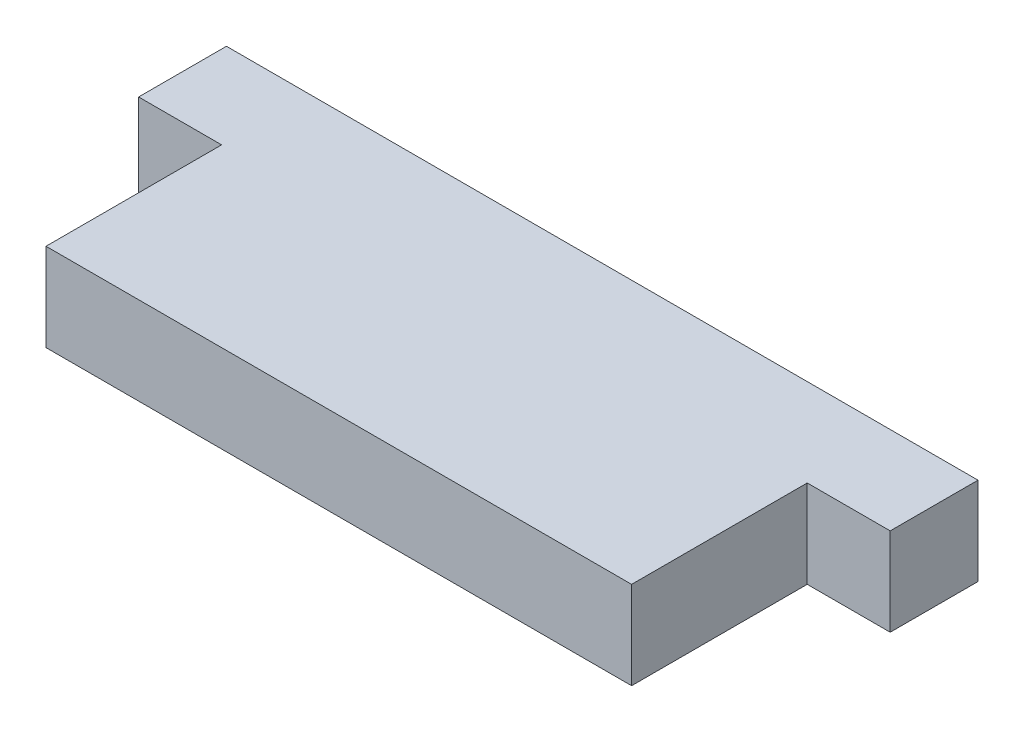
ISO-10303-21;
HEADER;
FILE_DESCRIPTION(('STEP AP214'),'2;1');
FILE_NAME('part.step','',(''),(''),'','','');
FILE_SCHEMA(('AUTOMOTIVE_DESIGN { 1 0 10303 214 1 1 1 1 }'));
ENDSEC;
DATA;
#1=APPLICATION_CONTEXT('core data for automotive mechanical design processes');
#2=APPLICATION_PROTOCOL_DEFINITION('international standard','automotive_design',2000,#1);
#3=PRODUCT_CONTEXT('',#1,'mechanical');
#4=PRODUCT('Part','Part','',(#3));
#5=PRODUCT_RELATED_PRODUCT_CATEGORY('part','',(#4));
#6=PRODUCT_DEFINITION_FORMATION('','',#4);
#7=PRODUCT_DEFINITION_CONTEXT('part definition',#1,'design');
#8=PRODUCT_DEFINITION('design','',#6,#7);
#9=PRODUCT_DEFINITION_SHAPE('','',#8);
#10=(LENGTH_UNIT() NAMED_UNIT(*) SI_UNIT(.MILLI.,.METRE.));
#11=(NAMED_UNIT(*) PLANE_ANGLE_UNIT() SI_UNIT($,.RADIAN.));
#12=(NAMED_UNIT(*) SI_UNIT($,.STERADIAN.) SOLID_ANGLE_UNIT());
#13=UNCERTAINTY_MEASURE_WITH_UNIT(LENGTH_MEASURE(1.E-05),#10,'distance_accuracy_value','');
#14=(GEOMETRIC_REPRESENTATION_CONTEXT(3) GLOBAL_UNCERTAINTY_ASSIGNED_CONTEXT((#13)) GLOBAL_UNIT_ASSIGNED_CONTEXT((#10,
#11,#12)) REPRESENTATION_CONTEXT('',''));
#15=CARTESIAN_POINT('',(0.,0.,0.));
#16=DIRECTION('',(0.,0.,1.));
#17=DIRECTION('',(1.,0.,0.));
#18=AXIS2_PLACEMENT_3D('',#15,#16,#17);
#19=CARTESIAN_POINT('',(0.,6.35,0.));
#20=DIRECTION('',(0.,0.,-1.));
#21=DIRECTION('',(-1.,0.,0.));
#22=AXIS2_PLACEMENT_3D('',#19,#20,#21);
#23=PLANE('',#22);
#24=DIRECTION('',(1.,0.,0.));
#25=VECTOR('',#24,1.);
#26=CARTESIAN_POINT('',(0.,0.,0.));
#27=LINE('',#26,#25);
#28=CARTESIAN_POINT('',(0.,0.,0.));
#29=VERTEX_POINT('',#28);
#30=CARTESIAN_POINT('',(42.350000136,0.,0.));
#31=VERTEX_POINT('',#30);
#32=EDGE_CURVE('E129',#29,#31,#27,.T.);
#33=ORIENTED_EDGE('',*,*,#32,.T.);
#34=DIRECTION('',(0.,-1.,0.));
#35=VECTOR('',#34,1.);
#36=CARTESIAN_POINT('',(42.350000136,6.35,0.));
#37=LINE('',#36,#35);
#38=CARTESIAN_POINT('',(42.350000136,6.35,0.));
#39=VERTEX_POINT('',#38);
#40=EDGE_CURVE('E11',#39,#31,#37,.T.);
#41=ORIENTED_EDGE('',*,*,#40,.F.);
#42=DIRECTION('',(1.,0.,0.));
#43=VECTOR('',#42,1.);
#44=CARTESIAN_POINT('',(0.,6.35,0.));
#45=LINE('',#44,#43);
#46=CARTESIAN_POINT('',(0.,6.35,0.));
#47=VERTEX_POINT('',#46);
#48=EDGE_CURVE('E143',#47,#39,#45,.T.);
#49=ORIENTED_EDGE('',*,*,#48,.F.);
#50=DIRECTION('',(0.,-1.,0.));
#51=VECTOR('',#50,1.);
#52=CARTESIAN_POINT('',(0.,6.35,0.));
#53=LINE('',#52,#51);
#54=EDGE_CURVE('E125',#47,#29,#53,.T.);
#55=ORIENTED_EDGE('',*,*,#54,.T.);
#56=EDGE_LOOP('',(#33,#41,#49,#55));
#57=FACE_BOUND('',#56,.T.);
#58=ADVANCED_FACE('F33',(#57),#23,.F.);
#59=CARTESIAN_POINT('',(42.350000136,6.35,0.));
#60=DIRECTION('',(-1.,0.,0.));
#61=DIRECTION('',(0.,0.,1.));
#62=AXIS2_PLACEMENT_3D('',#59,#60,#61);
#63=PLANE('',#62);
#64=DIRECTION('',(0.,0.,-1.));
#65=VECTOR('',#64,1.);
#66=CARTESIAN_POINT('',(42.350000136,0.,0.));
#67=LINE('',#66,#65);
#68=CARTESIAN_POINT('',(42.350000136,0.,-12.7));
#69=VERTEX_POINT('',#68);
#70=EDGE_CURVE('E132',#31,#69,#67,.T.);
#71=ORIENTED_EDGE('',*,*,#70,.T.);
#72=DIRECTION('',(0.,-1.,0.));
#73=VECTOR('',#72,1.);
#74=CARTESIAN_POINT('',(42.350000136,6.35,-12.7));
#75=LINE('',#74,#73);
#76=CARTESIAN_POINT('',(42.350000136,6.35,-12.7));
#77=VERTEX_POINT('',#76);
#78=EDGE_CURVE('E41',#77,#69,#75,.T.);
#79=ORIENTED_EDGE('',*,*,#78,.F.);
#80=DIRECTION('',(0.,0.,-1.));
#81=VECTOR('',#80,1.);
#82=CARTESIAN_POINT('',(42.350000136,6.35,0.));
#83=LINE('',#82,#81);
#84=EDGE_CURVE('E92',#39,#77,#83,.T.);
#85=ORIENTED_EDGE('',*,*,#84,.F.);
#86=ORIENTED_EDGE('',*,*,#40,.T.);
#87=EDGE_LOOP('',(#71,#79,#85,#86));
#88=FACE_BOUND('',#87,.T.);
#89=ADVANCED_FACE('F178',(#88),#63,.F.);
#90=CARTESIAN_POINT('',(42.350000136,6.35,-12.7));
#91=DIRECTION('',(0.,0.,-1.));
#92=DIRECTION('',(-1.,0.,0.));
#93=AXIS2_PLACEMENT_3D('',#90,#91,#92);
#94=PLANE('',#93);
#95=DIRECTION('',(1.,0.,0.));
#96=VECTOR('',#95,1.);
#97=CARTESIAN_POINT('',(42.350000136,0.,-12.7));
#98=LINE('',#97,#96);
#99=CARTESIAN_POINT('',(48.350089736,0.,-12.7));
#100=VERTEX_POINT('',#99);
#101=EDGE_CURVE('E134',#69,#100,#98,.T.);
#102=ORIENTED_EDGE('',*,*,#101,.T.);
#103=DIRECTION('',(0.,-1.,0.));
#104=VECTOR('',#103,1.);
#105=CARTESIAN_POINT('',(48.350089736,6.35,-12.7));
#106=LINE('',#105,#104);
#107=CARTESIAN_POINT('',(48.350089736,6.35,-12.7));
#108=VERTEX_POINT('',#107);
#109=EDGE_CURVE('E150',#108,#100,#106,.T.);
#110=ORIENTED_EDGE('',*,*,#109,.F.);
#111=DIRECTION('',(1.,0.,0.));
#112=VECTOR('',#111,1.);
#113=CARTESIAN_POINT('',(42.350000136,6.35,-12.7));
#114=LINE('',#113,#112);
#115=EDGE_CURVE('E158',#77,#108,#114,.T.);
#116=ORIENTED_EDGE('',*,*,#115,.F.);
#117=ORIENTED_EDGE('',*,*,#78,.T.);
#118=EDGE_LOOP('',(#102,#110,#116,#117));
#119=FACE_BOUND('',#118,.T.);
#120=ADVANCED_FACE('F156',(#119),#94,.F.);
#121=CARTESIAN_POINT('',(48.350089736,6.35,-19.05));
#122=DIRECTION('',(-1.,0.,0.));
#123=DIRECTION('',(0.,0.,1.));
#124=AXIS2_PLACEMENT_3D('',#121,#122,#123);
#125=PLANE('',#124);
#126=DIRECTION('',(0.,0.,-1.));
#127=VECTOR('',#126,1.);
#128=CARTESIAN_POINT('',(48.350089736,0.,-19.05));
#129=LINE('',#128,#127);
#130=CARTESIAN_POINT('',(48.350089736,0.,-19.05));
#131=VERTEX_POINT('',#130);
#132=EDGE_CURVE('E136',#100,#131,#129,.T.);
#133=ORIENTED_EDGE('',*,*,#132,.T.);
#134=DIRECTION('',(0.,-1.,0.));
#135=VECTOR('',#134,1.);
#136=CARTESIAN_POINT('',(48.350089736,6.35,-19.05));
#137=LINE('',#136,#135);
#138=CARTESIAN_POINT('',(48.350089736,6.35,-19.05));
#139=VERTEX_POINT('',#138);
#140=EDGE_CURVE('E147',#139,#131,#137,.T.);
#141=ORIENTED_EDGE('',*,*,#140,.F.);
#142=DIRECTION('',(0.,0.,-1.));
#143=VECTOR('',#142,1.);
#144=CARTESIAN_POINT('',(48.350089736,6.35,-19.05));
#145=LINE('',#144,#143);
#146=EDGE_CURVE('E170',#108,#139,#145,.T.);
#147=ORIENTED_EDGE('',*,*,#146,.F.);
#148=ORIENTED_EDGE('',*,*,#109,.T.);
#149=EDGE_LOOP('',(#133,#141,#147,#148));
#150=FACE_BOUND('',#149,.T.);
#151=ADVANCED_FACE('F166',(#150),#125,.F.);
#152=CARTESIAN_POINT('',(-6.0000896,6.35,-19.05));
#153=DIRECTION('',(0.,0.,1.));
#154=DIRECTION('',(1.,0.,0.));
#155=AXIS2_PLACEMENT_3D('',#152,#153,#154);
#156=PLANE('',#155);
#157=DIRECTION('',(-1.,0.,0.));
#158=VECTOR('',#157,1.);
#159=CARTESIAN_POINT('',(-6.0000896,0.,-19.05));
#160=LINE('',#159,#158);
#161=CARTESIAN_POINT('',(-6.0000896,0.,-19.05));
#162=VERTEX_POINT('',#161);
#163=EDGE_CURVE('E138',#131,#162,#160,.T.);
#164=ORIENTED_EDGE('',*,*,#163,.T.);
#165=DIRECTION('',(0.,-1.,0.));
#166=VECTOR('',#165,1.);
#167=CARTESIAN_POINT('',(-6.0000896,6.35,-19.05));
#168=LINE('',#167,#166);
#169=CARTESIAN_POINT('',(-6.0000896,6.35,-19.05));
#170=VERTEX_POINT('',#169);
#171=EDGE_CURVE('E120',#170,#162,#168,.T.);
#172=ORIENTED_EDGE('',*,*,#171,.F.);
#173=DIRECTION('',(-1.,0.,0.));
#174=VECTOR('',#173,1.);
#175=CARTESIAN_POINT('',(-6.0000896,6.35,-19.05));
#176=LINE('',#175,#174);
#177=EDGE_CURVE('E111',#139,#170,#176,.T.);
#178=ORIENTED_EDGE('',*,*,#177,.F.);
#179=ORIENTED_EDGE('',*,*,#140,.T.);
#180=EDGE_LOOP('',(#164,#172,#178,#179));
#181=FACE_BOUND('',#180,.T.);
#182=ADVANCED_FACE('F169',(#181),#156,.F.);
#183=CARTESIAN_POINT('',(-6.0000896,6.35,-19.05));
#184=DIRECTION('',(1.,0.,0.));
#185=DIRECTION('',(0.,0.,-1.));
#186=AXIS2_PLACEMENT_3D('',#183,#184,#185);
#187=PLANE('',#186);
#188=DIRECTION('',(0.,0.,1.));
#189=VECTOR('',#188,1.);
#190=CARTESIAN_POINT('',(-6.0000896,0.,-19.05));
#191=LINE('',#190,#189);
#192=CARTESIAN_POINT('',(-6.0000896,0.,-12.7));
#193=VERTEX_POINT('',#192);
#194=EDGE_CURVE('E119',#162,#193,#191,.T.);
#195=ORIENTED_EDGE('',*,*,#194,.T.);
#196=DIRECTION('',(0.,-1.,0.));
#197=VECTOR('',#196,1.);
#198=CARTESIAN_POINT('',(-6.0000896,6.35,-12.7));
#199=LINE('',#198,#197);
#200=CARTESIAN_POINT('',(-6.0000896,6.35,-12.7));
#201=VERTEX_POINT('',#200);
#202=EDGE_CURVE('E116',#201,#193,#199,.T.);
#203=ORIENTED_EDGE('',*,*,#202,.F.);
#204=DIRECTION('',(0.,0.,1.));
#205=VECTOR('',#204,1.);
#206=CARTESIAN_POINT('',(-6.0000896,6.35,-19.05));
#207=LINE('',#206,#205);
#208=EDGE_CURVE('E105',#170,#201,#207,.T.);
#209=ORIENTED_EDGE('',*,*,#208,.F.);
#210=ORIENTED_EDGE('',*,*,#171,.T.);
#211=EDGE_LOOP('',(#195,#203,#209,#210));
#212=FACE_BOUND('',#211,.T.);
#213=ADVANCED_FACE('F117',(#212),#187,.F.);
#214=CARTESIAN_POINT('',(-6.0000896,6.35,-12.7));
#215=DIRECTION('',(0.,0.,-1.));
#216=DIRECTION('',(-1.,0.,0.));
#217=AXIS2_PLACEMENT_3D('',#214,#215,#216);
#218=PLANE('',#217);
#219=DIRECTION('',(1.,0.,0.));
#220=VECTOR('',#219,1.);
#221=CARTESIAN_POINT('',(-6.0000896,0.,-12.7));
#222=LINE('',#221,#220);
#223=CARTESIAN_POINT('',(0.,0.,-12.7));
#224=VERTEX_POINT('',#223);
#225=EDGE_CURVE('E78',#193,#224,#222,.T.);
#226=ORIENTED_EDGE('',*,*,#225,.T.);
#227=DIRECTION('',(0.,-1.,0.));
#228=VECTOR('',#227,1.);
#229=CARTESIAN_POINT('',(0.,6.35,-12.7));
#230=LINE('',#229,#228);
#231=CARTESIAN_POINT('',(0.,6.35,-12.7));
#232=VERTEX_POINT('',#231);
#233=EDGE_CURVE('E121',#232,#224,#230,.T.);
#234=ORIENTED_EDGE('',*,*,#233,.F.);
#235=DIRECTION('',(1.,0.,0.));
#236=VECTOR('',#235,1.);
#237=CARTESIAN_POINT('',(-6.0000896,6.35,-12.7));
#238=LINE('',#237,#236);
#239=EDGE_CURVE('E109',#201,#232,#238,.T.);
#240=ORIENTED_EDGE('',*,*,#239,.F.);
#241=ORIENTED_EDGE('',*,*,#202,.T.);
#242=EDGE_LOOP('',(#226,#234,#240,#241));
#243=FACE_BOUND('',#242,.T.);
#244=ADVANCED_FACE('F123',(#243),#218,.F.);
#245=CARTESIAN_POINT('',(0.,6.35,0.));
#246=DIRECTION('',(1.,0.,0.));
#247=DIRECTION('',(0.,0.,-1.));
#248=AXIS2_PLACEMENT_3D('',#245,#246,#247);
#249=PLANE('',#248);
#250=DIRECTION('',(0.,0.,1.));
#251=VECTOR('',#250,1.);
#252=CARTESIAN_POINT('',(0.,0.,0.));
#253=LINE('',#252,#251);
#254=EDGE_CURVE('E84',#224,#29,#253,.T.);
#255=ORIENTED_EDGE('',*,*,#254,.T.);
#256=ORIENTED_EDGE('',*,*,#54,.F.);
#257=DIRECTION('',(0.,0.,1.));
#258=VECTOR('',#257,1.);
#259=CARTESIAN_POINT('',(0.,6.35,0.));
#260=LINE('',#259,#258);
#261=EDGE_CURVE('E49',#232,#47,#260,.T.);
#262=ORIENTED_EDGE('',*,*,#261,.F.);
#263=ORIENTED_EDGE('',*,*,#233,.T.);
#264=EDGE_LOOP('',(#255,#256,#262,#263));
#265=FACE_BOUND('',#264,.T.);
#266=ADVANCED_FACE('F194',(#265),#249,.F.);
#267=CARTESIAN_POINT('',(0.,6.35,0.));
#268=DIRECTION('',(0.,1.,0.));
#269=DIRECTION('',(0.,0.,1.));
#270=AXIS2_PLACEMENT_3D('',#267,#268,#269);
#271=PLANE('',#270);
#272=ORIENTED_EDGE('',*,*,#48,.T.);
#273=ORIENTED_EDGE('',*,*,#84,.T.);
#274=ORIENTED_EDGE('',*,*,#115,.T.);
#275=ORIENTED_EDGE('',*,*,#146,.T.);
#276=ORIENTED_EDGE('',*,*,#177,.T.);
#277=ORIENTED_EDGE('',*,*,#208,.T.);
#278=ORIENTED_EDGE('',*,*,#239,.T.);
#279=ORIENTED_EDGE('',*,*,#261,.T.);
#280=EDGE_LOOP('',(#272,#273,#274,#275,#276,#277,#278,#279));
#281=FACE_BOUND('',#280,.T.);
#282=ADVANCED_FACE('F107',(#281),#271,.T.);
#283=CARTESIAN_POINT('',(0.,0.,0.));
#284=DIRECTION('',(0.,1.,0.));
#285=DIRECTION('',(0.,0.,1.));
#286=AXIS2_PLACEMENT_3D('',#283,#284,#285);
#287=PLANE('',#286);
#288=ORIENTED_EDGE('',*,*,#32,.F.);
#289=ORIENTED_EDGE('',*,*,#254,.F.);
#290=ORIENTED_EDGE('',*,*,#225,.F.);
#291=ORIENTED_EDGE('',*,*,#194,.F.);
#292=ORIENTED_EDGE('',*,*,#163,.F.);
#293=ORIENTED_EDGE('',*,*,#132,.F.);
#294=ORIENTED_EDGE('',*,*,#101,.F.);
#295=ORIENTED_EDGE('',*,*,#70,.F.);
#296=EDGE_LOOP('',(#288,#289,#290,#291,#292,#293,#294,#295));
#297=FACE_BOUND('',#296,.T.);
#298=ADVANCED_FACE('F162',(#297),#287,.F.);
#299=CLOSED_SHELL('',(#58,#89,#120,#151,#182,#213,#244,#266,#282,#298));
#300=MANIFOLD_SOLID_BREP('B2',#299);
#301=ADVANCED_BREP_SHAPE_REPRESENTATION('',(#18,#300),#14);
#302=SHAPE_DEFINITION_REPRESENTATION(#9,#301);
ENDSEC;
END-ISO-10303-21;
